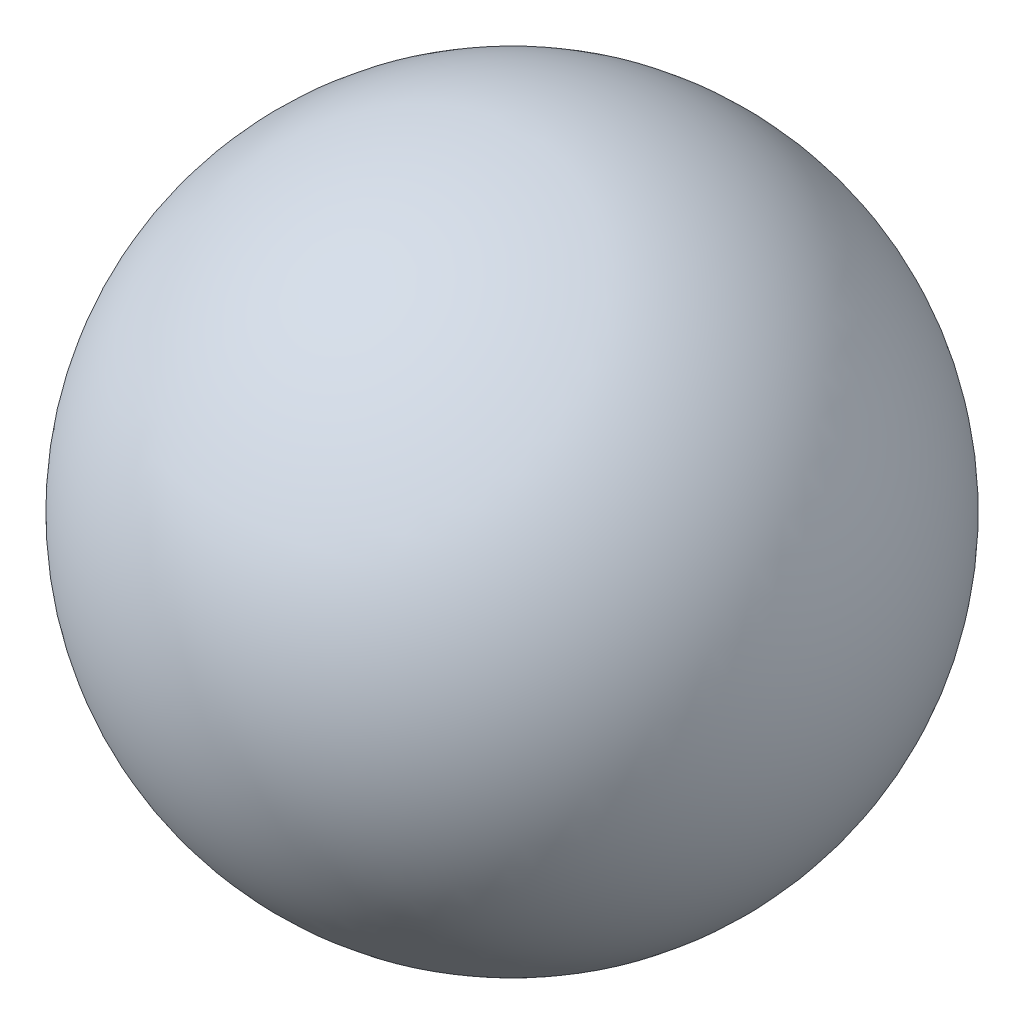
ISO-10303-21;
HEADER;
FILE_DESCRIPTION(('STEP AP214'),'2;1');
FILE_NAME('part.step','',(''),(''),'','','');
FILE_SCHEMA(('AUTOMOTIVE_DESIGN { 1 0 10303 214 1 1 1 1 }'));
ENDSEC;
DATA;
#1=APPLICATION_CONTEXT('core data for automotive mechanical design processes');
#2=APPLICATION_PROTOCOL_DEFINITION('international standard','automotive_design',2000,#1);
#3=PRODUCT_CONTEXT('',#1,'mechanical');
#4=PRODUCT('Part','Part','',(#3));
#5=PRODUCT_RELATED_PRODUCT_CATEGORY('part','',(#4));
#6=PRODUCT_DEFINITION_FORMATION('','',#4);
#7=PRODUCT_DEFINITION_CONTEXT('part definition',#1,'design');
#8=PRODUCT_DEFINITION('design','',#6,#7);
#9=PRODUCT_DEFINITION_SHAPE('','',#8);
#10=(LENGTH_UNIT() NAMED_UNIT(*) SI_UNIT(.MILLI.,.METRE.));
#11=(NAMED_UNIT(*) PLANE_ANGLE_UNIT() SI_UNIT($,.RADIAN.));
#12=(NAMED_UNIT(*) SI_UNIT($,.STERADIAN.) SOLID_ANGLE_UNIT());
#13=UNCERTAINTY_MEASURE_WITH_UNIT(LENGTH_MEASURE(1.E-05),#10,'distance_accuracy_value','');
#14=(GEOMETRIC_REPRESENTATION_CONTEXT(3) GLOBAL_UNCERTAINTY_ASSIGNED_CONTEXT((#13)) GLOBAL_UNIT_ASSIGNED_CONTEXT((#10,
#11,#12)) REPRESENTATION_CONTEXT('',''));
#15=CARTESIAN_POINT('',(0.,0.,0.));
#16=DIRECTION('',(0.,0.,1.));
#17=DIRECTION('',(1.,0.,0.));
#18=AXIS2_PLACEMENT_3D('',#15,#16,#17);
#19=CARTESIAN_POINT('',(0.,0.,0.));
#20=DIRECTION('',(0.,1.,0.));
#21=DIRECTION('',(1.,0.,0.));
#22=AXIS2_PLACEMENT_3D('',#19,#20,#21);
#23=SPHERICAL_SURFACE('',#22,6.35);
#24=CARTESIAN_POINT('',(0.,6.35,0.));
#25=VERTEX_POINT('',#24);
#26=VERTEX_LOOP('',#25);
#27=FACE_BOUND('',#26,.T.);
#28=ADVANCED_FACE('F32',(#27),#23,.T.);
#29=CLOSED_SHELL('',(#28));
#30=MANIFOLD_SOLID_BREP('B2',#29);
#31=ADVANCED_BREP_SHAPE_REPRESENTATION('',(#18,#30),#14);
#32=SHAPE_DEFINITION_REPRESENTATION(#9,#31);
ENDSEC;
END-ISO-10303-21;
